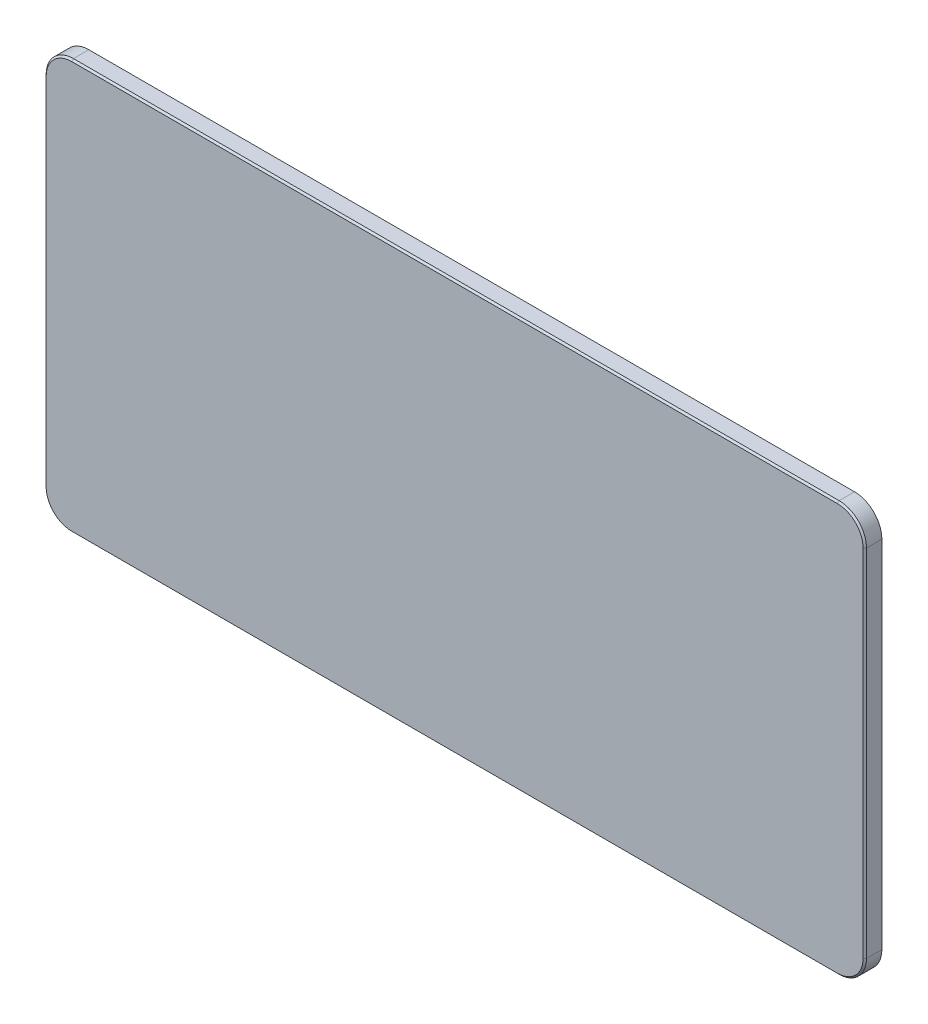
ISO-10303-21;
HEADER;
FILE_DESCRIPTION(('STEP AP214'),'2;1');
FILE_NAME('part.step','',(''),(''),'','','');
FILE_SCHEMA(('AUTOMOTIVE_DESIGN { 1 0 10303 214 1 1 1 1 }'));
ENDSEC;
DATA;
#1=APPLICATION_CONTEXT('core data for automotive mechanical design processes');
#2=APPLICATION_PROTOCOL_DEFINITION('international standard','automotive_design',2000,#1);
#3=PRODUCT_CONTEXT('',#1,'mechanical');
#4=PRODUCT('Part','Part','',(#3));
#5=PRODUCT_RELATED_PRODUCT_CATEGORY('part','',(#4));
#6=PRODUCT_DEFINITION_FORMATION('','',#4);
#7=PRODUCT_DEFINITION_CONTEXT('part definition',#1,'design');
#8=PRODUCT_DEFINITION('design','',#6,#7);
#9=PRODUCT_DEFINITION_SHAPE('','',#8);
#10=(LENGTH_UNIT() NAMED_UNIT(*) SI_UNIT(.MILLI.,.METRE.));
#11=(NAMED_UNIT(*) PLANE_ANGLE_UNIT() SI_UNIT($,.RADIAN.));
#12=(NAMED_UNIT(*) SI_UNIT($,.STERADIAN.) SOLID_ANGLE_UNIT());
#13=UNCERTAINTY_MEASURE_WITH_UNIT(LENGTH_MEASURE(1.E-05),#10,'distance_accuracy_value','');
#14=(GEOMETRIC_REPRESENTATION_CONTEXT(3) GLOBAL_UNCERTAINTY_ASSIGNED_CONTEXT((#13)) GLOBAL_UNIT_ASSIGNED_CONTEXT((#10,
#11,#12)) REPRESENTATION_CONTEXT('',''));
#15=CARTESIAN_POINT('',(0.,0.,0.));
#16=DIRECTION('',(0.,0.,1.));
#17=DIRECTION('',(1.,0.,0.));
#18=AXIS2_PLACEMENT_3D('',#15,#16,#17);
#19=CARTESIAN_POINT('',(-762.000000000005,-381.000000000002,15.875));
#20=DIRECTION('',(1.,0.,0.));
#21=DIRECTION('',(0.,0.,-1.));
#22=AXIS2_PLACEMENT_3D('',#19,#20,#21);
#23=PLANE('',#22);
#24=DIRECTION('',(0.,0.,-1.));
#25=VECTOR('',#24,1.);
#26=CARTESIAN_POINT('',(-762.000000000005,-330.200000000001,15.875));
#27=LINE('',#26,#25);
#28=CARTESIAN_POINT('',(-762.000000000005,-330.200000000001,-15.875));
#29=VERTEX_POINT('',#28);
#30=CARTESIAN_POINT('',(-762.000000000005,-330.200000000001,12.7));
#31=VERTEX_POINT('',#30);
#32=EDGE_CURVE('E255',#29,#31,#27,.F.);
#33=ORIENTED_EDGE('',*,*,#32,.T.);
#34=DIRECTION('',(0.,1.,0.));
#35=VECTOR('',#34,1.);
#36=CARTESIAN_POINT('',(-762.000000000005,-381.000000000002,12.7));
#37=LINE('',#36,#35);
#38=CARTESIAN_POINT('',(-762.000000000005,330.200000000001,12.7));
#39=VERTEX_POINT('',#38);
#40=EDGE_CURVE('E11',#31,#39,#37,.T.);
#41=ORIENTED_EDGE('',*,*,#40,.T.);
#42=DIRECTION('',(0.,0.,-1.));
#43=VECTOR('',#42,1.);
#44=CARTESIAN_POINT('',(-762.000000000005,330.200000000001,15.875));
#45=LINE('',#44,#43);
#46=CARTESIAN_POINT('',(-762.000000000005,330.200000000001,-15.875));
#47=VERTEX_POINT('',#46);
#48=EDGE_CURVE('E253',#39,#47,#45,.T.);
#49=ORIENTED_EDGE('',*,*,#48,.T.);
#50=DIRECTION('',(0.,-1.,0.));
#51=VECTOR('',#50,1.);
#52=CARTESIAN_POINT('',(-762.000000000005,-381.000000000002,-15.875));
#53=LINE('',#52,#51);
#54=EDGE_CURVE('E229',#47,#29,#53,.T.);
#55=ORIENTED_EDGE('',*,*,#54,.T.);
#56=EDGE_LOOP('',(#33,#41,#49,#55));
#57=FACE_BOUND('',#56,.T.);
#58=ADVANCED_FACE('F41',(#57),#23,.F.);
#59=CARTESIAN_POINT('',(-762.000000000005,-381.000000000002,15.875));
#60=DIRECTION('',(0.,1.,0.));
#61=DIRECTION('',(0.,0.,1.));
#62=AXIS2_PLACEMENT_3D('',#59,#60,#61);
#63=PLANE('',#62);
#64=DIRECTION('',(0.,0.,-1.));
#65=VECTOR('',#64,1.);
#66=CARTESIAN_POINT('',(711.200000000003,-381.000000000002,15.875));
#67=LINE('',#66,#65);
#68=CARTESIAN_POINT('',(711.200000000003,-381.000000000002,-15.875));
#69=VERTEX_POINT('',#68);
#70=CARTESIAN_POINT('',(711.200000000003,-381.000000000002,12.7));
#71=VERTEX_POINT('',#70);
#72=EDGE_CURVE('E241',#69,#71,#67,.F.);
#73=ORIENTED_EDGE('',*,*,#72,.T.);
#74=DIRECTION('',(-1.,0.,0.));
#75=VECTOR('',#74,1.);
#76=CARTESIAN_POINT('',(-762.000000000005,-381.000000000002,12.7));
#77=LINE('',#76,#75);
#78=CARTESIAN_POINT('',(-711.200000000003,-381.000000000002,12.7));
#79=VERTEX_POINT('',#78);
#80=EDGE_CURVE('E62',#71,#79,#77,.T.);
#81=ORIENTED_EDGE('',*,*,#80,.T.);
#82=DIRECTION('',(0.,0.,-1.));
#83=VECTOR('',#82,1.);
#84=CARTESIAN_POINT('',(-711.200000000003,-381.000000000002,15.875));
#85=LINE('',#84,#83);
#86=CARTESIAN_POINT('',(-711.200000000003,-381.000000000002,-15.875));
#87=VERTEX_POINT('',#86);
#88=EDGE_CURVE('E243',#79,#87,#85,.T.);
#89=ORIENTED_EDGE('',*,*,#88,.T.);
#90=DIRECTION('',(1.,0.,0.));
#91=VECTOR('',#90,1.);
#92=CARTESIAN_POINT('',(-762.000000000005,-381.000000000002,-15.875));
#93=LINE('',#92,#91);
#94=EDGE_CURVE('E232',#87,#69,#93,.T.);
#95=ORIENTED_EDGE('',*,*,#94,.T.);
#96=EDGE_LOOP('',(#73,#81,#89,#95));
#97=FACE_BOUND('',#96,.T.);
#98=ADVANCED_FACE('F304',(#97),#63,.F.);
#99=CARTESIAN_POINT('',(762.000000000005,-381.000000000002,15.875));
#100=DIRECTION('',(-1.,0.,0.));
#101=DIRECTION('',(0.,0.,1.));
#102=AXIS2_PLACEMENT_3D('',#99,#100,#101);
#103=PLANE('',#102);
#104=DIRECTION('',(0.,0.,-1.));
#105=VECTOR('',#104,1.);
#106=CARTESIAN_POINT('',(762.000000000005,330.200000000001,15.875));
#107=LINE('',#106,#105);
#108=CARTESIAN_POINT('',(762.000000000005,330.200000000001,-15.875));
#109=VERTEX_POINT('',#108);
#110=CARTESIAN_POINT('',(762.000000000005,330.200000000001,12.7));
#111=VERTEX_POINT('',#110);
#112=EDGE_CURVE('E257',#109,#111,#107,.F.);
#113=ORIENTED_EDGE('',*,*,#112,.T.);
#114=DIRECTION('',(0.,-1.,0.));
#115=VECTOR('',#114,1.);
#116=CARTESIAN_POINT('',(762.000000000005,-381.000000000002,12.7));
#117=LINE('',#116,#115);
#118=CARTESIAN_POINT('',(762.000000000005,-330.200000000001,12.7));
#119=VERTEX_POINT('',#118);
#120=EDGE_CURVE('E291',#111,#119,#117,.T.);
#121=ORIENTED_EDGE('',*,*,#120,.T.);
#122=DIRECTION('',(0.,0.,-1.));
#123=VECTOR('',#122,1.);
#124=CARTESIAN_POINT('',(762.000000000005,-330.200000000001,15.875));
#125=LINE('',#124,#123);
#126=CARTESIAN_POINT('',(762.000000000005,-330.200000000001,-15.875));
#127=VERTEX_POINT('',#126);
#128=EDGE_CURVE('E260',#119,#127,#125,.T.);
#129=ORIENTED_EDGE('',*,*,#128,.T.);
#130=DIRECTION('',(0.,1.,0.));
#131=VECTOR('',#130,1.);
#132=CARTESIAN_POINT('',(762.000000000005,-381.000000000002,-15.875));
#133=LINE('',#132,#131);
#134=EDGE_CURVE('E235',#127,#109,#133,.T.);
#135=ORIENTED_EDGE('',*,*,#134,.T.);
#136=EDGE_LOOP('',(#113,#121,#129,#135));
#137=FACE_BOUND('',#136,.T.);
#138=ADVANCED_FACE('F356',(#137),#103,.F.);
#139=CARTESIAN_POINT('',(-762.000000000005,381.000000000003,15.875));
#140=DIRECTION('',(0.,-1.,0.));
#141=DIRECTION('',(0.,0.,-1.));
#142=AXIS2_PLACEMENT_3D('',#139,#140,#141);
#143=PLANE('',#142);
#144=DIRECTION('',(0.,0.,-1.));
#145=VECTOR('',#144,1.);
#146=CARTESIAN_POINT('',(-711.200000000003,381.000000000003,15.875));
#147=LINE('',#146,#145);
#148=CARTESIAN_POINT('',(-711.200000000003,381.000000000003,-15.875));
#149=VERTEX_POINT('',#148);
#150=CARTESIAN_POINT('',(-711.200000000003,381.000000000003,12.7));
#151=VERTEX_POINT('',#150);
#152=EDGE_CURVE('E262',#149,#151,#147,.F.);
#153=ORIENTED_EDGE('',*,*,#152,.T.);
#154=DIRECTION('',(1.,0.,0.));
#155=VECTOR('',#154,1.);
#156=CARTESIAN_POINT('',(-762.000000000005,381.000000000003,12.7));
#157=LINE('',#156,#155);
#158=CARTESIAN_POINT('',(711.200000000003,381.000000000003,12.7));
#159=VERTEX_POINT('',#158);
#160=EDGE_CURVE('E287',#151,#159,#157,.T.);
#161=ORIENTED_EDGE('',*,*,#160,.T.);
#162=DIRECTION('',(0.,0.,-1.));
#163=VECTOR('',#162,1.);
#164=CARTESIAN_POINT('',(711.200000000003,381.000000000003,15.875));
#165=LINE('',#164,#163);
#166=CARTESIAN_POINT('',(711.200000000003,381.000000000003,-15.875));
#167=VERTEX_POINT('',#166);
#168=EDGE_CURVE('E265',#159,#167,#165,.T.);
#169=ORIENTED_EDGE('',*,*,#168,.T.);
#170=DIRECTION('',(-1.,0.,0.));
#171=VECTOR('',#170,1.);
#172=CARTESIAN_POINT('',(-762.000000000005,381.000000000003,-15.875));
#173=LINE('',#172,#171);
#174=EDGE_CURVE('E238',#167,#149,#173,.T.);
#175=ORIENTED_EDGE('',*,*,#174,.T.);
#176=EDGE_LOOP('',(#153,#161,#169,#175));
#177=FACE_BOUND('',#176,.T.);
#178=ADVANCED_FACE('F340',(#177),#143,.F.);
#179=CARTESIAN_POINT('',(-762.000000000005,381.000000000003,15.875));
#180=DIRECTION('',(0.,0.,-1.));
#181=DIRECTION('',(-1.,0.,0.));
#182=AXIS2_PLACEMENT_3D('',#179,#180,#181);
#183=PLANE('',#182);
#184=DIRECTION('',(-1.,0.,0.));
#185=VECTOR('',#184,1.);
#186=CARTESIAN_POINT('',(-762.000000000005,377.825000000003,15.875));
#187=LINE('',#186,#185);
#188=CARTESIAN_POINT('',(711.200000000003,377.825000000003,15.875));
#189=VERTEX_POINT('',#188);
#190=CARTESIAN_POINT('',(-711.200000000003,377.825000000003,15.875));
#191=VERTEX_POINT('',#190);
#192=EDGE_CURVE('E279',#189,#191,#187,.T.);
#193=ORIENTED_EDGE('',*,*,#192,.T.);
#194=CARTESIAN_POINT('',(-711.200000000003,330.200000000001,15.875));
#195=DIRECTION('',(0.,0.,-1.));
#196=DIRECTION('',(-1.,0.,0.));
#197=AXIS2_PLACEMENT_3D('',#194,#195,#196);
#198=CIRCLE('',#197,47.6249999999999);
#199=CARTESIAN_POINT('',(-758.825000000005,330.200000000001,15.875));
#200=VERTEX_POINT('',#199);
#201=EDGE_CURVE('E281',#191,#200,#198,.F.);
#202=ORIENTED_EDGE('',*,*,#201,.T.);
#203=DIRECTION('',(0.,-1.,0.));
#204=VECTOR('',#203,1.);
#205=CARTESIAN_POINT('',(-758.825000000005,381.000000000003,15.875));
#206=LINE('',#205,#204);
#207=CARTESIAN_POINT('',(-758.825000000005,-330.200000000001,15.875));
#208=VERTEX_POINT('',#207);
#209=EDGE_CURVE('E267',#200,#208,#206,.T.);
#210=ORIENTED_EDGE('',*,*,#209,.T.);
#211=CARTESIAN_POINT('',(-711.200000000003,-330.200000000001,15.875));
#212=DIRECTION('',(0.,0.,-1.));
#213=DIRECTION('',(-1.,0.,0.));
#214=AXIS2_PLACEMENT_3D('',#211,#212,#213);
#215=CIRCLE('',#214,47.625);
#216=CARTESIAN_POINT('',(-711.200000000003,-377.825000000002,15.875));
#217=VERTEX_POINT('',#216);
#218=EDGE_CURVE('E269',#208,#217,#215,.F.);
#219=ORIENTED_EDGE('',*,*,#218,.T.);
#220=DIRECTION('',(1.,0.,0.));
#221=VECTOR('',#220,1.);
#222=CARTESIAN_POINT('',(-762.000000000005,-377.825000000002,15.875));
#223=LINE('',#222,#221);
#224=CARTESIAN_POINT('',(711.200000000003,-377.825000000002,15.875));
#225=VERTEX_POINT('',#224);
#226=EDGE_CURVE('E271',#217,#225,#223,.T.);
#227=ORIENTED_EDGE('',*,*,#226,.T.);
#228=CARTESIAN_POINT('',(711.200000000003,-330.200000000001,15.875));
#229=DIRECTION('',(0.,0.,-1.));
#230=DIRECTION('',(-1.,0.,0.));
#231=AXIS2_PLACEMENT_3D('',#228,#229,#230);
#232=CIRCLE('',#231,47.6249999999999);
#233=CARTESIAN_POINT('',(758.825000000005,-330.200000000001,15.875));
#234=VERTEX_POINT('',#233);
#235=EDGE_CURVE('E273',#225,#234,#232,.F.);
#236=ORIENTED_EDGE('',*,*,#235,.T.);
#237=DIRECTION('',(0.,1.,0.));
#238=VECTOR('',#237,1.);
#239=CARTESIAN_POINT('',(758.825000000005,381.000000000003,15.875));
#240=LINE('',#239,#238);
#241=CARTESIAN_POINT('',(758.825000000005,330.200000000001,15.875));
#242=VERTEX_POINT('',#241);
#243=EDGE_CURVE('E275',#234,#242,#240,.T.);
#244=ORIENTED_EDGE('',*,*,#243,.T.);
#245=CARTESIAN_POINT('',(711.200000000003,330.200000000001,15.875));
#246=DIRECTION('',(0.,0.,-1.));
#247=DIRECTION('',(-1.,0.,0.));
#248=AXIS2_PLACEMENT_3D('',#245,#246,#247);
#249=CIRCLE('',#248,47.625);
#250=EDGE_CURVE('E277',#242,#189,#249,.F.);
#251=ORIENTED_EDGE('',*,*,#250,.T.);
#252=EDGE_LOOP('',(#193,#202,#210,#219,#227,#236,#244,#251));
#253=FACE_BOUND('',#252,.T.);
#254=ADVANCED_FACE('F369',(#253),#183,.F.);
#255=CARTESIAN_POINT('',(-762.000000000005,381.000000000003,-15.875));
#256=DIRECTION('',(0.,0.,-1.));
#257=DIRECTION('',(-1.,0.,0.));
#258=AXIS2_PLACEMENT_3D('',#255,#256,#257);
#259=PLANE('',#258);
#260=CARTESIAN_POINT('',(660.400000000003,-177.800000000001,-15.875));
#261=DIRECTION('',(0.,0.,1.));
#262=DIRECTION('',(-1.,0.,0.));
#263=AXIS2_PLACEMENT_3D('',#260,#261,#262);
#264=CIRCLE('',#263,4.7625);
#265=CARTESIAN_POINT('',(655.637500000003,-177.800000000001,-15.875));
#266=VERTEX_POINT('',#265);
#267=EDGE_CURVE('E161',#266,#266,#264,.T.);
#268=ORIENTED_EDGE('',*,*,#267,.T.);
#269=EDGE_LOOP('',(#268));
#270=FACE_BOUND('',#269,.T.);
#271=CARTESIAN_POINT('',(-660.400000000003,-177.800000000001,-15.875));
#272=DIRECTION('',(0.,0.,-1.));
#273=DIRECTION('',(1.,0.,0.));
#274=AXIS2_PLACEMENT_3D('',#271,#272,#273);
#275=CIRCLE('',#274,4.7625);
#276=CARTESIAN_POINT('',(-655.637500000003,-177.800000000001,-15.875));
#277=VERTEX_POINT('',#276);
#278=EDGE_CURVE('E160',#277,#277,#275,.T.);
#279=ORIENTED_EDGE('',*,*,#278,.F.);
#280=EDGE_LOOP('',(#279));
#281=FACE_BOUND('',#280,.T.);
#282=CARTESIAN_POINT('',(660.400000000003,-279.400000000001,-15.875));
#283=DIRECTION('',(0.,0.,1.));
#284=DIRECTION('',(-1.,0.,0.));
#285=AXIS2_PLACEMENT_3D('',#282,#283,#284);
#286=CIRCLE('',#285,4.7625);
#287=CARTESIAN_POINT('',(655.637500000003,-279.400000000001,-15.875));
#288=VERTEX_POINT('',#287);
#289=EDGE_CURVE('E171',#288,#288,#286,.T.);
#290=ORIENTED_EDGE('',*,*,#289,.T.);
#291=EDGE_LOOP('',(#290));
#292=FACE_BOUND('',#291,.T.);
#293=CARTESIAN_POINT('',(-660.400000000003,-279.400000000001,-15.875));
#294=DIRECTION('',(0.,0.,-1.));
#295=DIRECTION('',(1.,0.,0.));
#296=AXIS2_PLACEMENT_3D('',#293,#294,#295);
#297=CIRCLE('',#296,4.7625);
#298=CARTESIAN_POINT('',(-655.637500000003,-279.400000000001,-15.875));
#299=VERTEX_POINT('',#298);
#300=EDGE_CURVE('E177',#299,#299,#297,.T.);
#301=ORIENTED_EDGE('',*,*,#300,.F.);
#302=EDGE_LOOP('',(#301));
#303=FACE_BOUND('',#302,.T.);
#304=CARTESIAN_POINT('',(-660.400000000003,177.800000000001,-15.875));
#305=DIRECTION('',(0.,0.,1.));
#306=DIRECTION('',(1.,0.,0.));
#307=AXIS2_PLACEMENT_3D('',#304,#305,#306);
#308=CIRCLE('',#307,4.7625);
#309=CARTESIAN_POINT('',(-655.637500000003,177.800000000001,-15.875));
#310=VERTEX_POINT('',#309);
#311=EDGE_CURVE('E183',#310,#310,#308,.T.);
#312=ORIENTED_EDGE('',*,*,#311,.T.);
#313=EDGE_LOOP('',(#312));
#314=FACE_BOUND('',#313,.T.);
#315=CARTESIAN_POINT('',(-660.400000000003,279.400000000001,-15.875));
#316=DIRECTION('',(0.,0.,1.));
#317=DIRECTION('',(1.,0.,0.));
#318=AXIS2_PLACEMENT_3D('',#315,#316,#317);
#319=CIRCLE('',#318,4.7625);
#320=CARTESIAN_POINT('',(-655.637500000003,279.400000000001,-15.875));
#321=VERTEX_POINT('',#320);
#322=EDGE_CURVE('E189',#321,#321,#319,.T.);
#323=ORIENTED_EDGE('',*,*,#322,.T.);
#324=EDGE_LOOP('',(#323));
#325=FACE_BOUND('',#324,.T.);
#326=CARTESIAN_POINT('',(660.400000000003,279.400000000001,-15.875));
#327=DIRECTION('',(0.,0.,-1.));
#328=DIRECTION('',(-1.,0.,0.));
#329=AXIS2_PLACEMENT_3D('',#326,#327,#328);
#330=CIRCLE('',#329,4.7625);
#331=CARTESIAN_POINT('',(655.637500000003,279.400000000001,-15.875));
#332=VERTEX_POINT('',#331);
#333=EDGE_CURVE('E198',#332,#332,#330,.T.);
#334=ORIENTED_EDGE('',*,*,#333,.F.);
#335=EDGE_LOOP('',(#334));
#336=FACE_BOUND('',#335,.T.);
#337=CARTESIAN_POINT('',(660.400000000003,177.800000000001,-15.875));
#338=DIRECTION('',(0.,0.,-1.));
#339=DIRECTION('',(-1.,0.,0.));
#340=AXIS2_PLACEMENT_3D('',#337,#338,#339);
#341=CIRCLE('',#340,4.7625);
#342=CARTESIAN_POINT('',(655.637500000003,177.800000000001,-15.875));
#343=VERTEX_POINT('',#342);
#344=EDGE_CURVE('E204',#343,#343,#341,.T.);
#345=ORIENTED_EDGE('',*,*,#344,.F.);
#346=EDGE_LOOP('',(#345));
#347=FACE_BOUND('',#346,.T.);
#348=ORIENTED_EDGE('',*,*,#94,.F.);
#349=CARTESIAN_POINT('',(-711.200000000003,-330.200000000001,-15.875));
#350=DIRECTION('',(0.,0.,-1.));
#351=DIRECTION('',(-1.,0.,0.));
#352=AXIS2_PLACEMENT_3D('',#349,#350,#351);
#353=CIRCLE('',#352,50.8);
#354=EDGE_CURVE('E251',#87,#29,#353,.T.);
#355=ORIENTED_EDGE('',*,*,#354,.T.);
#356=ORIENTED_EDGE('',*,*,#54,.F.);
#357=CARTESIAN_POINT('',(-711.200000000003,330.200000000001,-15.875));
#358=DIRECTION('',(0.,0.,-1.));
#359=DIRECTION('',(-1.,0.,0.));
#360=AXIS2_PLACEMENT_3D('',#357,#358,#359);
#361=CIRCLE('',#360,50.8);
#362=EDGE_CURVE('E245',#47,#149,#361,.T.);
#363=ORIENTED_EDGE('',*,*,#362,.T.);
#364=ORIENTED_EDGE('',*,*,#174,.F.);
#365=CARTESIAN_POINT('',(711.200000000003,330.200000000001,-15.875));
#366=DIRECTION('',(0.,0.,-1.));
#367=DIRECTION('',(-1.,0.,0.));
#368=AXIS2_PLACEMENT_3D('',#365,#366,#367);
#369=CIRCLE('',#368,50.8);
#370=EDGE_CURVE('E247',#167,#109,#369,.T.);
#371=ORIENTED_EDGE('',*,*,#370,.T.);
#372=ORIENTED_EDGE('',*,*,#134,.F.);
#373=CARTESIAN_POINT('',(711.200000000003,-330.200000000001,-15.875));
#374=DIRECTION('',(0.,0.,-1.));
#375=DIRECTION('',(-1.,0.,0.));
#376=AXIS2_PLACEMENT_3D('',#373,#374,#375);
#377=CIRCLE('',#376,50.8);
#378=EDGE_CURVE('E249',#127,#69,#377,.T.);
#379=ORIENTED_EDGE('',*,*,#378,.T.);
#380=EDGE_LOOP('',(#348,#355,#356,#363,#364,#371,#372,#379));
#381=FACE_BOUND('',#380,.T.);
#382=ADVANCED_FACE('F359',(#270,#281,#292,#303,#314,#325,#336,#347,#381),#259,.T.);
#383=CARTESIAN_POINT('',(-711.200000000003,-330.200000000001,15.875));
#384=DIRECTION('',(0.,0.,-1.));
#385=DIRECTION('',(-1.,0.,0.));
#386=AXIS2_PLACEMENT_3D('',#383,#384,#385);
#387=CYLINDRICAL_SURFACE('',#386,50.8);
#388=ORIENTED_EDGE('',*,*,#88,.F.);
#389=CARTESIAN_POINT('',(-711.200000000003,-330.200000000001,12.7));
#390=DIRECTION('',(0.,0.,-1.));
#391=DIRECTION('',(-1.,0.,0.));
#392=AXIS2_PLACEMENT_3D('',#389,#390,#391);
#393=CIRCLE('',#392,50.8);
#394=EDGE_CURVE('E48',#79,#31,#393,.T.);
#395=ORIENTED_EDGE('',*,*,#394,.T.);
#396=ORIENTED_EDGE('',*,*,#32,.F.);
#397=ORIENTED_EDGE('',*,*,#354,.F.);
#398=EDGE_LOOP('',(#388,#395,#396,#397));
#399=FACE_BOUND('',#398,.T.);
#400=ADVANCED_FACE('F361',(#399),#387,.T.);
#401=CARTESIAN_POINT('',(711.200000000003,-330.200000000001,15.875));
#402=DIRECTION('',(0.,0.,-1.));
#403=DIRECTION('',(-1.,0.,0.));
#404=AXIS2_PLACEMENT_3D('',#401,#402,#403);
#405=CYLINDRICAL_SURFACE('',#404,50.8);
#406=ORIENTED_EDGE('',*,*,#128,.F.);
#407=CARTESIAN_POINT('',(711.200000000003,-330.200000000001,12.7));
#408=DIRECTION('',(0.,0.,-1.));
#409=DIRECTION('',(-1.,0.,0.));
#410=AXIS2_PLACEMENT_3D('',#407,#408,#409);
#411=CIRCLE('',#410,50.8);
#412=EDGE_CURVE('E293',#119,#71,#411,.T.);
#413=ORIENTED_EDGE('',*,*,#412,.T.);
#414=ORIENTED_EDGE('',*,*,#72,.F.);
#415=ORIENTED_EDGE('',*,*,#378,.F.);
#416=EDGE_LOOP('',(#406,#413,#414,#415));
#417=FACE_BOUND('',#416,.T.);
#418=ADVANCED_FACE('F299',(#417),#405,.T.);
#419=CARTESIAN_POINT('',(711.200000000003,330.200000000001,15.875));
#420=DIRECTION('',(0.,0.,-1.));
#421=DIRECTION('',(-1.,0.,0.));
#422=AXIS2_PLACEMENT_3D('',#419,#420,#421);
#423=CYLINDRICAL_SURFACE('',#422,50.8);
#424=ORIENTED_EDGE('',*,*,#168,.F.);
#425=CARTESIAN_POINT('',(711.200000000003,330.200000000001,12.7));
#426=DIRECTION('',(0.,0.,-1.));
#427=DIRECTION('',(-1.,0.,0.));
#428=AXIS2_PLACEMENT_3D('',#425,#426,#427);
#429=CIRCLE('',#428,50.8);
#430=EDGE_CURVE('E289',#159,#111,#429,.T.);
#431=ORIENTED_EDGE('',*,*,#430,.T.);
#432=ORIENTED_EDGE('',*,*,#112,.F.);
#433=ORIENTED_EDGE('',*,*,#370,.F.);
#434=EDGE_LOOP('',(#424,#431,#432,#433));
#435=FACE_BOUND('',#434,.T.);
#436=ADVANCED_FACE('F344',(#435),#423,.T.);
#437=CARTESIAN_POINT('',(-711.200000000003,330.200000000001,15.875));
#438=DIRECTION('',(0.,0.,-1.));
#439=DIRECTION('',(-1.,0.,0.));
#440=AXIS2_PLACEMENT_3D('',#437,#438,#439);
#441=CYLINDRICAL_SURFACE('',#440,50.8);
#442=ORIENTED_EDGE('',*,*,#48,.F.);
#443=CARTESIAN_POINT('',(-711.200000000003,330.200000000001,12.7));
#444=DIRECTION('',(0.,0.,-1.));
#445=DIRECTION('',(-1.,0.,0.));
#446=AXIS2_PLACEMENT_3D('',#443,#444,#445);
#447=CIRCLE('',#446,50.8);
#448=EDGE_CURVE('E284',#39,#151,#447,.T.);
#449=ORIENTED_EDGE('',*,*,#448,.T.);
#450=ORIENTED_EDGE('',*,*,#152,.F.);
#451=ORIENTED_EDGE('',*,*,#362,.F.);
#452=EDGE_LOOP('',(#442,#449,#450,#451));
#453=FACE_BOUND('',#452,.T.);
#454=ADVANCED_FACE('F326',(#453),#441,.T.);
#455=CARTESIAN_POINT('',(711.200000000003,-330.200000000001,15.875));
#456=DIRECTION('',(0.,0.,-1.));
#457=DIRECTION('',(-1.,0.,0.));
#458=AXIS2_PLACEMENT_3D('',#455,#456,#457);
#459=CONICAL_SURFACE('',#458,47.6249999999999,0.785398163397461);
#460=DIRECTION('',(0.,0.70710678118656,0.707106781186537));
#461=VECTOR('',#460,1.);
#462=CARTESIAN_POINT('',(711.200000000003,-381.000000000002,12.7));
#463=LINE('',#462,#461);
#464=EDGE_CURVE('E223',#71,#225,#463,.T.);
#465=ORIENTED_EDGE('',*,*,#464,.F.);
#466=ORIENTED_EDGE('',*,*,#412,.F.);
#467=DIRECTION('',(0.707106781186554,0.,-0.707106781186543));
#468=VECTOR('',#467,1.);
#469=CARTESIAN_POINT('',(758.825000000005,-330.200000000001,15.875));
#470=LINE('',#469,#468);
#471=EDGE_CURVE('E226',#234,#119,#470,.T.);
#472=ORIENTED_EDGE('',*,*,#471,.F.);
#473=ORIENTED_EDGE('',*,*,#235,.F.);
#474=EDGE_LOOP('',(#465,#466,#472,#473));
#475=FACE_BOUND('',#474,.T.);
#476=ADVANCED_FACE('F307',(#475),#459,.T.);
#477=CARTESIAN_POINT('',(758.825000000005,381.000000000003,15.875));
#478=DIRECTION('',(-0.707106781186558,0.,-0.707106781186539));
#479=DIRECTION('',(-0.707106781186542,0.,0.707106781186556));
#480=AXIS2_PLACEMENT_3D('',#477,#478,#479);
#481=PLANE('',#480);
#482=ORIENTED_EDGE('',*,*,#471,.T.);
#483=ORIENTED_EDGE('',*,*,#120,.F.);
#484=DIRECTION('',(0.707106781186542,0.,-0.707106781186556));
#485=VECTOR('',#484,1.);
#486=CARTESIAN_POINT('',(758.825000000005,330.200000000001,15.875));
#487=LINE('',#486,#485);
#488=EDGE_CURVE('E220',#242,#111,#487,.T.);
#489=ORIENTED_EDGE('',*,*,#488,.F.);
#490=ORIENTED_EDGE('',*,*,#243,.F.);
#491=EDGE_LOOP('',(#482,#483,#489,#490));
#492=FACE_BOUND('',#491,.T.);
#493=ADVANCED_FACE('F354',(#492),#481,.F.);
#494=CARTESIAN_POINT('',(-762.000000000005,-377.825000000002,15.875));
#495=DIRECTION('',(0.,0.707106781186546,-0.707106781186552));
#496=DIRECTION('',(0.,0.707106781186554,0.707106781186543));
#497=AXIS2_PLACEMENT_3D('',#494,#495,#496);
#498=PLANE('',#497);
#499=ORIENTED_EDGE('',*,*,#464,.T.);
#500=ORIENTED_EDGE('',*,*,#226,.F.);
#501=DIRECTION('',(0.,0.707106781186554,0.707106781186543));
#502=VECTOR('',#501,1.);
#503=CARTESIAN_POINT('',(-711.200000000003,-381.000000000002,12.7));
#504=LINE('',#503,#502);
#505=EDGE_CURVE('E217',#79,#217,#504,.T.);
#506=ORIENTED_EDGE('',*,*,#505,.F.);
#507=ORIENTED_EDGE('',*,*,#80,.F.);
#508=EDGE_LOOP('',(#499,#500,#506,#507));
#509=FACE_BOUND('',#508,.T.);
#510=ADVANCED_FACE('F311',(#509),#498,.F.);
#511=CARTESIAN_POINT('',(711.200000000003,330.200000000001,15.875));
#512=DIRECTION('',(0.,0.,-1.));
#513=DIRECTION('',(-1.,0.,0.));
#514=AXIS2_PLACEMENT_3D('',#511,#512,#513);
#515=CONICAL_SURFACE('',#514,47.625,0.785398163397452);
#516=ORIENTED_EDGE('',*,*,#488,.T.);
#517=ORIENTED_EDGE('',*,*,#430,.F.);
#518=DIRECTION('',(0.,0.707106781186554,-0.707106781186543));
#519=VECTOR('',#518,1.);
#520=CARTESIAN_POINT('',(711.200000000003,377.825000000003,15.875));
#521=LINE('',#520,#519);
#522=EDGE_CURVE('E214',#189,#159,#521,.T.);
#523=ORIENTED_EDGE('',*,*,#522,.F.);
#524=ORIENTED_EDGE('',*,*,#250,.F.);
#525=EDGE_LOOP('',(#516,#517,#523,#524));
#526=FACE_BOUND('',#525,.T.);
#527=ADVANCED_FACE('F348',(#526),#515,.T.);
#528=CARTESIAN_POINT('',(-711.200000000003,-330.200000000001,15.875));
#529=DIRECTION('',(0.,0.,-1.));
#530=DIRECTION('',(-1.,0.,0.));
#531=AXIS2_PLACEMENT_3D('',#528,#529,#530);
#532=CONICAL_SURFACE('',#531,47.625,0.785398163397452);
#533=ORIENTED_EDGE('',*,*,#505,.T.);
#534=ORIENTED_EDGE('',*,*,#218,.F.);
#535=DIRECTION('',(0.707106781186554,0.,0.707106781186543));
#536=VECTOR('',#535,1.);
#537=CARTESIAN_POINT('',(-762.000000000005,-330.200000000001,12.7));
#538=LINE('',#537,#536);
#539=EDGE_CURVE('E211',#31,#208,#538,.T.);
#540=ORIENTED_EDGE('',*,*,#539,.F.);
#541=ORIENTED_EDGE('',*,*,#394,.F.);
#542=EDGE_LOOP('',(#533,#534,#540,#541));
#543=FACE_BOUND('',#542,.T.);
#544=ADVANCED_FACE('F315',(#543),#532,.T.);
#545=CARTESIAN_POINT('',(-762.000000000005,377.825000000003,15.875));
#546=DIRECTION('',(0.,-0.707106781186546,-0.707106781186552));
#547=DIRECTION('',(0.,0.707106781186554,-0.707106781186543));
#548=AXIS2_PLACEMENT_3D('',#545,#546,#547);
#549=PLANE('',#548);
#550=ORIENTED_EDGE('',*,*,#522,.T.);
#551=ORIENTED_EDGE('',*,*,#160,.F.);
#552=DIRECTION('',(0.,0.707106781186554,-0.707106781186543));
#553=VECTOR('',#552,1.);
#554=CARTESIAN_POINT('',(-711.200000000003,377.825000000003,15.875));
#555=LINE('',#554,#553);
#556=EDGE_CURVE('E209',#191,#151,#555,.T.);
#557=ORIENTED_EDGE('',*,*,#556,.F.);
#558=ORIENTED_EDGE('',*,*,#192,.F.);
#559=EDGE_LOOP('',(#550,#551,#557,#558));
#560=FACE_BOUND('',#559,.T.);
#561=ADVANCED_FACE('F336',(#560),#549,.F.);
#562=CARTESIAN_POINT('',(-758.825000000005,381.000000000003,15.875));
#563=DIRECTION('',(0.707106781186546,0.,-0.707106781186552));
#564=DIRECTION('',(-0.707106781186554,0.,-0.707106781186543));
#565=AXIS2_PLACEMENT_3D('',#562,#563,#564);
#566=PLANE('',#565);
#567=ORIENTED_EDGE('',*,*,#539,.T.);
#568=ORIENTED_EDGE('',*,*,#209,.F.);
#569=DIRECTION('',(0.707106781186554,0.,0.707106781186543));
#570=VECTOR('',#569,1.);
#571=CARTESIAN_POINT('',(-762.000000000005,330.200000000001,12.7));
#572=LINE('',#571,#570);
#573=EDGE_CURVE('E207',#39,#200,#572,.T.);
#574=ORIENTED_EDGE('',*,*,#573,.F.);
#575=ORIENTED_EDGE('',*,*,#40,.F.);
#576=EDGE_LOOP('',(#567,#568,#574,#575));
#577=FACE_BOUND('',#576,.T.);
#578=ADVANCED_FACE('F320',(#577),#566,.F.);
#579=CARTESIAN_POINT('',(-711.200000000003,330.200000000001,15.875));
#580=DIRECTION('',(0.,0.,-1.));
#581=DIRECTION('',(-1.,0.,0.));
#582=AXIS2_PLACEMENT_3D('',#579,#580,#581);
#583=CONICAL_SURFACE('',#582,47.6249999999999,0.785398163397461);
#584=ORIENTED_EDGE('',*,*,#556,.T.);
#585=ORIENTED_EDGE('',*,*,#448,.F.);
#586=ORIENTED_EDGE('',*,*,#573,.T.);
#587=ORIENTED_EDGE('',*,*,#201,.F.);
#588=EDGE_LOOP('',(#584,#585,#586,#587));
#589=FACE_BOUND('',#588,.T.);
#590=ADVANCED_FACE('F330',(#589),#583,.T.);
#591=CARTESIAN_POINT('',(660.400000000003,177.800000000001,-15.875));
#592=DIRECTION('',(0.,0.,-1.));
#593=DIRECTION('',(-1.,0.,0.));
#594=AXIS2_PLACEMENT_3D('',#591,#592,#593);
#595=CYLINDRICAL_SURFACE('',#594,4.7625);
#596=CARTESIAN_POINT('',(660.400000000003,177.800000000001,9.52500000000001));
#597=DIRECTION('',(0.,0.,-1.));
#598=DIRECTION('',(-1.,0.,0.));
#599=AXIS2_PLACEMENT_3D('',#596,#597,#598);
#600=CIRCLE('',#599,4.7625);
#601=CARTESIAN_POINT('',(655.637500000003,177.800000000001,9.52500000000001));
#602=VERTEX_POINT('',#601);
#603=EDGE_CURVE('E201',#602,#602,#600,.T.);
#604=ORIENTED_EDGE('',*,*,#603,.F.);
#605=EDGE_LOOP('',(#604));
#606=FACE_BOUND('',#605,.T.);
#607=ORIENTED_EDGE('',*,*,#344,.T.);
#608=EDGE_LOOP('',(#607));
#609=FACE_BOUND('',#608,.T.);
#610=ADVANCED_FACE('F488',(#606,#609),#595,.F.);
#611=CARTESIAN_POINT('',(660.400000000003,177.800000000001,9.52500000000001));
#612=DIRECTION('',(0.,0.,-1.));
#613=DIRECTION('',(-1.,0.,0.));
#614=AXIS2_PLACEMENT_3D('',#611,#612,#613);
#615=CONICAL_SURFACE('',#614,4.7625,1.02974425867665);
#616=CARTESIAN_POINT('',(660.400000000003,177.800000000001,12.3865986981188));
#617=VERTEX_POINT('',#616);
#618=VERTEX_LOOP('',#617);
#619=FACE_BOUND('',#618,.T.);
#620=ORIENTED_EDGE('',*,*,#603,.T.);
#621=EDGE_LOOP('',(#620));
#622=FACE_BOUND('',#621,.T.);
#623=ADVANCED_FACE('F497',(#619,#622),#615,.F.);
#624=CARTESIAN_POINT('',(660.400000000003,279.400000000001,-15.875));
#625=DIRECTION('',(0.,0.,-1.));
#626=DIRECTION('',(-1.,0.,0.));
#627=AXIS2_PLACEMENT_3D('',#624,#625,#626);
#628=CYLINDRICAL_SURFACE('',#627,4.7625);
#629=CARTESIAN_POINT('',(660.400000000003,279.400000000001,9.52500000000001));
#630=DIRECTION('',(0.,0.,-1.));
#631=DIRECTION('',(-1.,0.,0.));
#632=AXIS2_PLACEMENT_3D('',#629,#630,#631);
#633=CIRCLE('',#632,4.7625);
#634=CARTESIAN_POINT('',(655.637500000003,279.400000000001,9.52500000000001));
#635=VERTEX_POINT('',#634);
#636=EDGE_CURVE('E195',#635,#635,#633,.T.);
#637=ORIENTED_EDGE('',*,*,#636,.F.);
#638=EDGE_LOOP('',(#637));
#639=FACE_BOUND('',#638,.T.);
#640=ORIENTED_EDGE('',*,*,#333,.T.);
#641=EDGE_LOOP('',(#640));
#642=FACE_BOUND('',#641,.T.);
#643=ADVANCED_FACE('F507',(#639,#642),#628,.F.);
#644=CARTESIAN_POINT('',(660.400000000003,279.400000000001,9.52500000000001));
#645=DIRECTION('',(0.,0.,-1.));
#646=DIRECTION('',(-1.,0.,0.));
#647=AXIS2_PLACEMENT_3D('',#644,#645,#646);
#648=CONICAL_SURFACE('',#647,4.7625,1.02974425867665);
#649=CARTESIAN_POINT('',(660.400000000003,279.400000000001,12.3865986981188));
#650=VERTEX_POINT('',#649);
#651=VERTEX_LOOP('',#650);
#652=FACE_BOUND('',#651,.T.);
#653=ORIENTED_EDGE('',*,*,#636,.T.);
#654=EDGE_LOOP('',(#653));
#655=FACE_BOUND('',#654,.T.);
#656=ADVANCED_FACE('F517',(#652,#655),#648,.F.);
#657=CARTESIAN_POINT('',(-660.400000000003,279.400000000001,-15.875));
#658=DIRECTION('',(0.,0.,-1.));
#659=DIRECTION('',(1.,0.,0.));
#660=AXIS2_PLACEMENT_3D('',#657,#658,#659);
#661=CYLINDRICAL_SURFACE('',#660,4.7625);
#662=CARTESIAN_POINT('',(-660.400000000003,279.400000000001,9.52500000000001));
#663=DIRECTION('',(0.,0.,1.));
#664=DIRECTION('',(1.,0.,0.));
#665=AXIS2_PLACEMENT_3D('',#662,#663,#664);
#666=CIRCLE('',#665,4.7625);
#667=CARTESIAN_POINT('',(-655.637500000003,279.400000000001,9.52500000000001));
#668=VERTEX_POINT('',#667);
#669=EDGE_CURVE('E192',#668,#668,#666,.T.);
#670=ORIENTED_EDGE('',*,*,#669,.T.);
#671=EDGE_LOOP('',(#670));
#672=FACE_BOUND('',#671,.T.);
#673=ORIENTED_EDGE('',*,*,#322,.F.);
#674=EDGE_LOOP('',(#673));
#675=FACE_BOUND('',#674,.T.);
#676=ADVANCED_FACE('F527',(#672,#675),#661,.F.);
#677=CARTESIAN_POINT('',(-660.400000000003,279.400000000001,9.52500000000001));
#678=DIRECTION('',(0.,0.,-1.));
#679=DIRECTION('',(1.,0.,0.));
#680=AXIS2_PLACEMENT_3D('',#677,#678,#679);
#681=CONICAL_SURFACE('',#680,4.7625,1.02974425867665);
#682=CARTESIAN_POINT('',(-660.400000000003,279.400000000001,12.3865986981188));
#683=VERTEX_POINT('',#682);
#684=VERTEX_LOOP('',#683);
#685=FACE_BOUND('',#684,.T.);
#686=ORIENTED_EDGE('',*,*,#669,.F.);
#687=EDGE_LOOP('',(#686));
#688=FACE_BOUND('',#687,.T.);
#689=ADVANCED_FACE('F537',(#685,#688),#681,.F.);
#690=CARTESIAN_POINT('',(-660.400000000003,177.800000000001,-15.875));
#691=DIRECTION('',(0.,0.,-1.));
#692=DIRECTION('',(1.,0.,0.));
#693=AXIS2_PLACEMENT_3D('',#690,#691,#692);
#694=CYLINDRICAL_SURFACE('',#693,4.7625);
#695=CARTESIAN_POINT('',(-660.400000000003,177.800000000001,9.52500000000001));
#696=DIRECTION('',(0.,0.,1.));
#697=DIRECTION('',(1.,0.,0.));
#698=AXIS2_PLACEMENT_3D('',#695,#696,#697);
#699=CIRCLE('',#698,4.7625);
#700=CARTESIAN_POINT('',(-655.637500000003,177.800000000001,9.52500000000001));
#701=VERTEX_POINT('',#700);
#702=EDGE_CURVE('E186',#701,#701,#699,.T.);
#703=ORIENTED_EDGE('',*,*,#702,.T.);
#704=EDGE_LOOP('',(#703));
#705=FACE_BOUND('',#704,.T.);
#706=ORIENTED_EDGE('',*,*,#311,.F.);
#707=EDGE_LOOP('',(#706));
#708=FACE_BOUND('',#707,.T.);
#709=ADVANCED_FACE('F547',(#705,#708),#694,.F.);
#710=CARTESIAN_POINT('',(-660.400000000003,177.800000000001,9.52500000000001));
#711=DIRECTION('',(0.,0.,-1.));
#712=DIRECTION('',(1.,0.,0.));
#713=AXIS2_PLACEMENT_3D('',#710,#711,#712);
#714=CONICAL_SURFACE('',#713,4.7625,1.02974425867665);
#715=CARTESIAN_POINT('',(-660.400000000003,177.800000000001,12.3865986981188));
#716=VERTEX_POINT('',#715);
#717=VERTEX_LOOP('',#716);
#718=FACE_BOUND('',#717,.T.);
#719=ORIENTED_EDGE('',*,*,#702,.F.);
#720=EDGE_LOOP('',(#719));
#721=FACE_BOUND('',#720,.T.);
#722=ADVANCED_FACE('F557',(#718,#721),#714,.F.);
#723=CARTESIAN_POINT('',(-660.400000000003,-279.400000000001,-15.875));
#724=DIRECTION('',(0.,0.,-1.));
#725=DIRECTION('',(1.,0.,0.));
#726=AXIS2_PLACEMENT_3D('',#723,#724,#725);
#727=CYLINDRICAL_SURFACE('',#726,4.7625);
#728=CARTESIAN_POINT('',(-660.400000000003,-279.400000000001,9.52500000000001));
#729=DIRECTION('',(0.,0.,-1.));
#730=DIRECTION('',(1.,0.,0.));
#731=AXIS2_PLACEMENT_3D('',#728,#729,#730);
#732=CIRCLE('',#731,4.7625);
#733=CARTESIAN_POINT('',(-655.637500000003,-279.400000000001,9.52500000000001));
#734=VERTEX_POINT('',#733);
#735=EDGE_CURVE('E180',#734,#734,#732,.T.);
#736=ORIENTED_EDGE('',*,*,#735,.F.);
#737=EDGE_LOOP('',(#736));
#738=FACE_BOUND('',#737,.T.);
#739=ORIENTED_EDGE('',*,*,#300,.T.);
#740=EDGE_LOOP('',(#739));
#741=FACE_BOUND('',#740,.T.);
#742=ADVANCED_FACE('F567',(#738,#741),#727,.F.);
#743=CARTESIAN_POINT('',(-660.400000000003,-279.400000000001,9.52500000000001));
#744=DIRECTION('',(0.,0.,-1.));
#745=DIRECTION('',(1.,0.,0.));
#746=AXIS2_PLACEMENT_3D('',#743,#744,#745);
#747=CONICAL_SURFACE('',#746,4.7625,1.02974425867665);
#748=CARTESIAN_POINT('',(-660.400000000003,-279.400000000001,12.3865986981188));
#749=VERTEX_POINT('',#748);
#750=VERTEX_LOOP('',#749);
#751=FACE_BOUND('',#750,.T.);
#752=ORIENTED_EDGE('',*,*,#735,.T.);
#753=EDGE_LOOP('',(#752));
#754=FACE_BOUND('',#753,.T.);
#755=ADVANCED_FACE('F570',(#751,#754),#747,.F.);
#756=CARTESIAN_POINT('',(660.400000000003,-279.400000000001,-15.875));
#757=DIRECTION('',(0.,0.,-1.));
#758=DIRECTION('',(-1.,0.,0.));
#759=AXIS2_PLACEMENT_3D('',#756,#757,#758);
#760=CYLINDRICAL_SURFACE('',#759,4.7625);
#761=CARTESIAN_POINT('',(660.400000000003,-279.400000000001,9.52500000000001));
#762=DIRECTION('',(0.,0.,1.));
#763=DIRECTION('',(-1.,0.,0.));
#764=AXIS2_PLACEMENT_3D('',#761,#762,#763);
#765=CIRCLE('',#764,4.7625);
#766=CARTESIAN_POINT('',(655.637500000003,-279.400000000001,9.52500000000001));
#767=VERTEX_POINT('',#766);
#768=EDGE_CURVE('E174',#767,#767,#765,.T.);
#769=ORIENTED_EDGE('',*,*,#768,.T.);
#770=EDGE_LOOP('',(#769));
#771=FACE_BOUND('',#770,.T.);
#772=ORIENTED_EDGE('',*,*,#289,.F.);
#773=EDGE_LOOP('',(#772));
#774=FACE_BOUND('',#773,.T.);
#775=ADVANCED_FACE('F580',(#771,#774),#760,.F.);
#776=CARTESIAN_POINT('',(660.400000000003,-279.400000000001,9.52500000000001));
#777=DIRECTION('',(0.,0.,-1.));
#778=DIRECTION('',(-1.,0.,0.));
#779=AXIS2_PLACEMENT_3D('',#776,#777,#778);
#780=CONICAL_SURFACE('',#779,4.7625,1.02974425867665);
#781=CARTESIAN_POINT('',(660.400000000003,-279.400000000001,12.3865986981188));
#782=VERTEX_POINT('',#781);
#783=VERTEX_LOOP('',#782);
#784=FACE_BOUND('',#783,.T.);
#785=ORIENTED_EDGE('',*,*,#768,.F.);
#786=EDGE_LOOP('',(#785));
#787=FACE_BOUND('',#786,.T.);
#788=ADVANCED_FACE('F597',(#784,#787),#780,.F.);
#789=CARTESIAN_POINT('',(-660.400000000003,-177.800000000001,-15.875));
#790=DIRECTION('',(0.,0.,-1.));
#791=DIRECTION('',(1.,0.,0.));
#792=AXIS2_PLACEMENT_3D('',#789,#790,#791);
#793=CYLINDRICAL_SURFACE('',#792,4.7625);
#794=CARTESIAN_POINT('',(-660.400000000003,-177.800000000001,9.52500000000001));
#795=DIRECTION('',(0.,0.,-1.));
#796=DIRECTION('',(1.,0.,0.));
#797=AXIS2_PLACEMENT_3D('',#794,#795,#796);
#798=CIRCLE('',#797,4.7625);
#799=CARTESIAN_POINT('',(-655.637500000003,-177.800000000001,9.52500000000001));
#800=VERTEX_POINT('',#799);
#801=EDGE_CURVE('E164',#800,#800,#798,.T.);
#802=ORIENTED_EDGE('',*,*,#801,.F.);
#803=EDGE_LOOP('',(#802));
#804=FACE_BOUND('',#803,.T.);
#805=ORIENTED_EDGE('',*,*,#278,.T.);
#806=EDGE_LOOP('',(#805));
#807=FACE_BOUND('',#806,.T.);
#808=ADVANCED_FACE('F607',(#804,#807),#793,.F.);
#809=CARTESIAN_POINT('',(-660.400000000003,-177.800000000001,9.52500000000001));
#810=DIRECTION('',(0.,0.,-1.));
#811=DIRECTION('',(1.,0.,0.));
#812=AXIS2_PLACEMENT_3D('',#809,#810,#811);
#813=CONICAL_SURFACE('',#812,4.7625,1.02974425867665);
#814=CARTESIAN_POINT('',(-660.400000000003,-177.800000000001,12.3865986981188));
#815=VERTEX_POINT('',#814);
#816=VERTEX_LOOP('',#815);
#817=FACE_BOUND('',#816,.T.);
#818=ORIENTED_EDGE('',*,*,#801,.T.);
#819=EDGE_LOOP('',(#818));
#820=FACE_BOUND('',#819,.T.);
#821=ADVANCED_FACE('F610',(#817,#820),#813,.F.);
#822=CARTESIAN_POINT('',(660.400000000003,-177.800000000001,-15.875));
#823=DIRECTION('',(0.,0.,-1.));
#824=DIRECTION('',(-1.,0.,0.));
#825=AXIS2_PLACEMENT_3D('',#822,#823,#824);
#826=CYLINDRICAL_SURFACE('',#825,4.7625);
#827=CARTESIAN_POINT('',(660.400000000003,-177.800000000001,9.52500000000001));
#828=DIRECTION('',(0.,0.,1.));
#829=DIRECTION('',(-1.,0.,0.));
#830=AXIS2_PLACEMENT_3D('',#827,#828,#829);
#831=CIRCLE('',#830,4.7625);
#832=CARTESIAN_POINT('',(655.637500000003,-177.800000000001,9.52500000000001));
#833=VERTEX_POINT('',#832);
#834=EDGE_CURVE('E158',#833,#833,#831,.T.);
#835=ORIENTED_EDGE('',*,*,#834,.T.);
#836=EDGE_LOOP('',(#835));
#837=FACE_BOUND('',#836,.T.);
#838=ORIENTED_EDGE('',*,*,#267,.F.);
#839=EDGE_LOOP('',(#838));
#840=FACE_BOUND('',#839,.T.);
#841=ADVANCED_FACE('F154',(#837,#840),#826,.F.);
#842=CARTESIAN_POINT('',(660.400000000003,-177.800000000001,9.52500000000001));
#843=DIRECTION('',(0.,0.,-1.));
#844=DIRECTION('',(-1.,0.,0.));
#845=AXIS2_PLACEMENT_3D('',#842,#843,#844);
#846=CONICAL_SURFACE('',#845,4.7625,1.02974425867665);
#847=CARTESIAN_POINT('',(660.400000000003,-177.800000000001,12.3865986981188));
#848=VERTEX_POINT('',#847);
#849=VERTEX_LOOP('',#848);
#850=FACE_BOUND('',#849,.T.);
#851=ORIENTED_EDGE('',*,*,#834,.F.);
#852=EDGE_LOOP('',(#851));
#853=FACE_BOUND('',#852,.T.);
#854=ADVANCED_FACE('F151',(#850,#853),#846,.F.);
#855=CLOSED_SHELL('',(#58,#98,#138,#178,#254,#382,#400,#418,#436,#454,#476,#493,#510,#527,#544,
#561,#578,#590,#610,#623,#643,#656,#676,#689,#709,#722,#742,#755,#775,#788,#808,#821,#841,#854));
#856=MANIFOLD_SOLID_BREP('B2',#855);
#857=ADVANCED_BREP_SHAPE_REPRESENTATION('',(#18,#856),#14);
#858=SHAPE_DEFINITION_REPRESENTATION(#9,#857);
ENDSEC;
END-ISO-10303-21;
